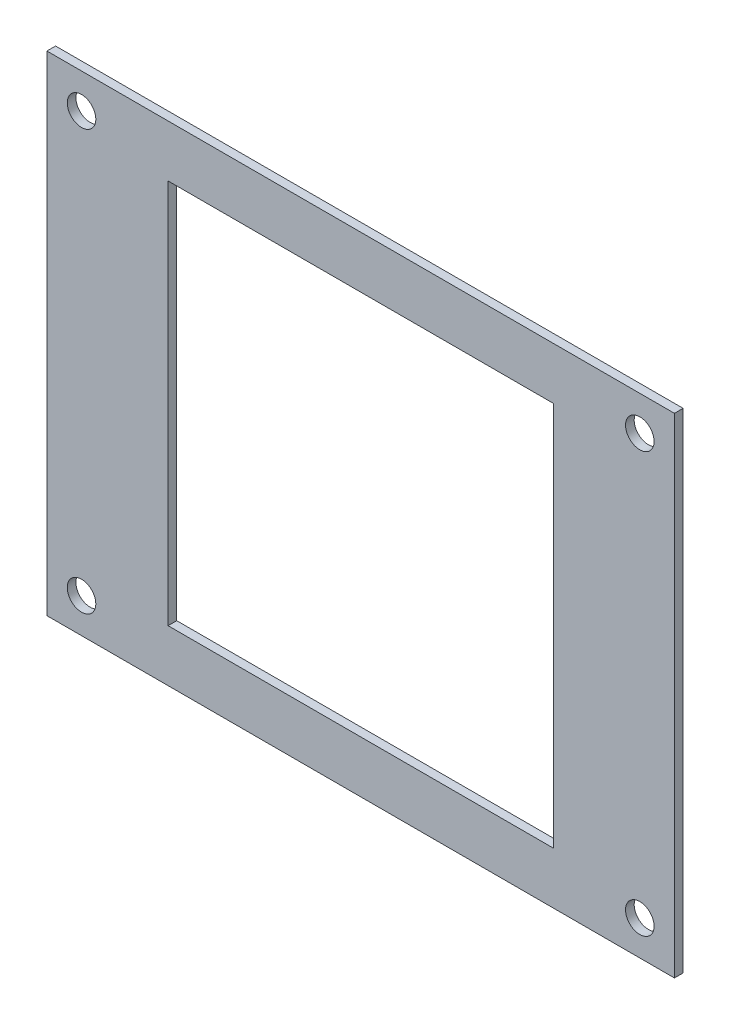
ISO-10303-21;
HEADER;
FILE_DESCRIPTION(('STEP AP214'),'2;1');
FILE_NAME('part.step','',(''),(''),'','','');
FILE_SCHEMA(('AUTOMOTIVE_DESIGN { 1 0 10303 214 1 1 1 1 }'));
ENDSEC;
DATA;
#1=APPLICATION_CONTEXT('core data for automotive mechanical design processes');
#2=APPLICATION_PROTOCOL_DEFINITION('international standard','automotive_design',2000,#1);
#3=PRODUCT_CONTEXT('',#1,'mechanical');
#4=PRODUCT('Part','Part','',(#3));
#5=PRODUCT_RELATED_PRODUCT_CATEGORY('part','',(#4));
#6=PRODUCT_DEFINITION_FORMATION('','',#4);
#7=PRODUCT_DEFINITION_CONTEXT('part definition',#1,'design');
#8=PRODUCT_DEFINITION('design','',#6,#7);
#9=PRODUCT_DEFINITION_SHAPE('','',#8);
#10=(LENGTH_UNIT() NAMED_UNIT(*) SI_UNIT(.MILLI.,.METRE.));
#11=(NAMED_UNIT(*) PLANE_ANGLE_UNIT() SI_UNIT($,.RADIAN.));
#12=(NAMED_UNIT(*) SI_UNIT($,.STERADIAN.) SOLID_ANGLE_UNIT());
#13=UNCERTAINTY_MEASURE_WITH_UNIT(LENGTH_MEASURE(1.E-05),#10,'distance_accuracy_value','');
#14=(GEOMETRIC_REPRESENTATION_CONTEXT(3) GLOBAL_UNCERTAINTY_ASSIGNED_CONTEXT((#13)) GLOBAL_UNIT_ASSIGNED_CONTEXT((#10,
#11,#12)) REPRESENTATION_CONTEXT('',''));
#15=CARTESIAN_POINT('',(0.,0.,0.));
#16=DIRECTION('',(0.,0.,1.));
#17=DIRECTION('',(1.,0.,0.));
#18=AXIS2_PLACEMENT_3D('',#15,#16,#17);
#19=CARTESIAN_POINT('',(0.,0.,1.));
#20=DIRECTION('',(0.,0.,-1.));
#21=DIRECTION('',(-1.,0.,0.));
#22=AXIS2_PLACEMENT_3D('',#19,#20,#21);
#23=PLANE('',#22);
#24=CARTESIAN_POINT('',(-4.,4.,1.));
#25=DIRECTION('',(0.,0.,1.));
#26=DIRECTION('',(1.,0.,0.));
#27=AXIS2_PLACEMENT_3D('',#24,#25,#26);
#28=CIRCLE('',#27,1.65);
#29=CARTESIAN_POINT('',(-2.35,4.,1.));
#30=VERTEX_POINT('',#29);
#31=EDGE_CURVE('E159',#30,#30,#28,.T.);
#32=ORIENTED_EDGE('',*,*,#31,.F.);
#33=EDGE_LOOP('',(#32));
#34=FACE_BOUND('',#33,.T.);
#35=CARTESIAN_POINT('',(-4.,52.5,1.));
#36=DIRECTION('',(0.,0.,1.));
#37=DIRECTION('',(1.,0.,0.));
#38=AXIS2_PLACEMENT_3D('',#35,#36,#37);
#39=CIRCLE('',#38,1.65);
#40=CARTESIAN_POINT('',(-2.35,52.5,1.));
#41=VERTEX_POINT('',#40);
#42=EDGE_CURVE('E167',#41,#41,#39,.T.);
#43=ORIENTED_EDGE('',*,*,#42,.F.);
#44=EDGE_LOOP('',(#43));
#45=FACE_BOUND('',#44,.T.);
#46=CARTESIAN_POINT('',(-68.5,52.5,1.));
#47=DIRECTION('',(0.,0.,1.));
#48=DIRECTION('',(1.,0.,0.));
#49=AXIS2_PLACEMENT_3D('',#46,#47,#48);
#50=CIRCLE('',#49,1.65);
#51=CARTESIAN_POINT('',(-66.85,52.5,1.));
#52=VERTEX_POINT('',#51);
#53=EDGE_CURVE('E175',#52,#52,#50,.T.);
#54=ORIENTED_EDGE('',*,*,#53,.F.);
#55=EDGE_LOOP('',(#54));
#56=FACE_BOUND('',#55,.T.);
#57=CARTESIAN_POINT('',(-68.5,4.,1.));
#58=DIRECTION('',(0.,0.,1.));
#59=DIRECTION('',(1.,0.,0.));
#60=AXIS2_PLACEMENT_3D('',#57,#58,#59);
#61=CIRCLE('',#60,1.65);
#62=CARTESIAN_POINT('',(-66.85,4.,1.));
#63=VERTEX_POINT('',#62);
#64=EDGE_CURVE('E183',#63,#63,#61,.T.);
#65=ORIENTED_EDGE('',*,*,#64,.F.);
#66=EDGE_LOOP('',(#65));
#67=FACE_BOUND('',#66,.T.);
#68=DIRECTION('',(1.,0.,0.));
#69=VECTOR('',#68,1.);
#70=CARTESIAN_POINT('',(0.,0.,1.));
#71=LINE('',#70,#69);
#72=CARTESIAN_POINT('',(-72.5,0.,1.));
#73=VERTEX_POINT('',#72);
#74=CARTESIAN_POINT('',(0.,0.,1.));
#75=VERTEX_POINT('',#74);
#76=EDGE_CURVE('E191',#73,#75,#71,.T.);
#77=ORIENTED_EDGE('',*,*,#76,.T.);
#78=DIRECTION('',(0.,1.,0.));
#79=VECTOR('',#78,1.);
#80=CARTESIAN_POINT('',(0.,0.,1.));
#81=LINE('',#80,#79);
#82=CARTESIAN_POINT('',(0.,56.5,1.));
#83=VERTEX_POINT('',#82);
#84=EDGE_CURVE('E195',#75,#83,#81,.T.);
#85=ORIENTED_EDGE('',*,*,#84,.T.);
#86=DIRECTION('',(-1.,0.,0.));
#87=VECTOR('',#86,1.);
#88=CARTESIAN_POINT('',(0.,56.5,1.));
#89=LINE('',#88,#87);
#90=CARTESIAN_POINT('',(-72.5,56.5,1.));
#91=VERTEX_POINT('',#90);
#92=EDGE_CURVE('E199',#83,#91,#89,.T.);
#93=ORIENTED_EDGE('',*,*,#92,.T.);
#94=DIRECTION('',(0.,-1.,0.));
#95=VECTOR('',#94,1.);
#96=CARTESIAN_POINT('',(-72.5,0.,1.));
#97=LINE('',#96,#95);
#98=EDGE_CURVE('E202',#91,#73,#97,.T.);
#99=ORIENTED_EDGE('',*,*,#98,.T.);
#100=EDGE_LOOP('',(#77,#85,#93,#99));
#101=FACE_BOUND('',#100,.T.);
#102=DIRECTION('',(1.,0.,0.));
#103=VECTOR('',#102,1.);
#104=CARTESIAN_POINT('',(-14.,6.,1.));
#105=LINE('',#104,#103);
#106=CARTESIAN_POINT('',(-58.5,6.,1.));
#107=VERTEX_POINT('',#106);
#108=CARTESIAN_POINT('',(-14.,6.,1.));
#109=VERTEX_POINT('',#108);
#110=EDGE_CURVE('E111',#107,#109,#105,.T.);
#111=ORIENTED_EDGE('',*,*,#110,.F.);
#112=DIRECTION('',(0.,-1.,0.));
#113=VECTOR('',#112,1.);
#114=CARTESIAN_POINT('',(-58.5,6.,1.));
#115=LINE('',#114,#113);
#116=CARTESIAN_POINT('',(-58.5,50.5,1.));
#117=VERTEX_POINT('',#116);
#118=EDGE_CURVE('E137',#117,#107,#115,.T.);
#119=ORIENTED_EDGE('',*,*,#118,.F.);
#120=DIRECTION('',(-1.,0.,0.));
#121=VECTOR('',#120,1.);
#122=CARTESIAN_POINT('',(-14.,50.5,1.));
#123=LINE('',#122,#121);
#124=CARTESIAN_POINT('',(-14.,50.5,1.));
#125=VERTEX_POINT('',#124);
#126=EDGE_CURVE('E133',#125,#117,#123,.T.);
#127=ORIENTED_EDGE('',*,*,#126,.F.);
#128=DIRECTION('',(0.,1.,0.));
#129=VECTOR('',#128,1.);
#130=CARTESIAN_POINT('',(-14.,6.,1.));
#131=LINE('',#130,#129);
#132=EDGE_CURVE('E120',#109,#125,#131,.T.);
#133=ORIENTED_EDGE('',*,*,#132,.F.);
#134=EDGE_LOOP('',(#111,#119,#127,#133));
#135=FACE_BOUND('',#134,.T.);
#136=ADVANCED_FACE('F45',(#34,#45,#56,#67,#101,#135),#23,.F.);
#137=CARTESIAN_POINT('',(0.,0.,0.));
#138=DIRECTION('',(0.,0.,-1.));
#139=DIRECTION('',(-1.,0.,0.));
#140=AXIS2_PLACEMENT_3D('',#137,#138,#139);
#141=PLANE('',#140);
#142=CARTESIAN_POINT('',(-4.,52.5,0.));
#143=DIRECTION('',(0.,0.,1.));
#144=DIRECTION('',(1.,0.,0.));
#145=AXIS2_PLACEMENT_3D('',#142,#143,#144);
#146=CIRCLE('',#145,1.65);
#147=CARTESIAN_POINT('',(-2.35,52.5,0.));
#148=VERTEX_POINT('',#147);
#149=EDGE_CURVE('E163',#148,#148,#146,.T.);
#150=ORIENTED_EDGE('',*,*,#149,.T.);
#151=EDGE_LOOP('',(#150));
#152=FACE_BOUND('',#151,.T.);
#153=CARTESIAN_POINT('',(-68.5,4.,0.));
#154=DIRECTION('',(0.,0.,1.));
#155=DIRECTION('',(1.,0.,0.));
#156=AXIS2_PLACEMENT_3D('',#153,#154,#155);
#157=CIRCLE('',#156,1.65);
#158=CARTESIAN_POINT('',(-66.85,4.,0.));
#159=VERTEX_POINT('',#158);
#160=EDGE_CURVE('E179',#159,#159,#157,.T.);
#161=ORIENTED_EDGE('',*,*,#160,.T.);
#162=EDGE_LOOP('',(#161));
#163=FACE_BOUND('',#162,.T.);
#164=DIRECTION('',(1.,0.,0.));
#165=VECTOR('',#164,1.);
#166=CARTESIAN_POINT('',(0.,0.,0.));
#167=LINE('',#166,#165);
#168=CARTESIAN_POINT('',(-72.5,0.,0.));
#169=VERTEX_POINT('',#168);
#170=CARTESIAN_POINT('',(0.,0.,0.));
#171=VERTEX_POINT('',#170);
#172=EDGE_CURVE('E187',#169,#171,#167,.T.);
#173=ORIENTED_EDGE('',*,*,#172,.F.);
#174=DIRECTION('',(0.,-1.,0.));
#175=VECTOR('',#174,1.);
#176=CARTESIAN_POINT('',(-72.5,0.,0.));
#177=LINE('',#176,#175);
#178=CARTESIAN_POINT('',(-72.5,56.5,0.));
#179=VERTEX_POINT('',#178);
#180=EDGE_CURVE('E196',#179,#169,#177,.T.);
#181=ORIENTED_EDGE('',*,*,#180,.F.);
#182=DIRECTION('',(-1.,0.,0.));
#183=VECTOR('',#182,1.);
#184=CARTESIAN_POINT('',(0.,56.5,0.));
#185=LINE('',#184,#183);
#186=CARTESIAN_POINT('',(0.,56.5,0.));
#187=VERTEX_POINT('',#186);
#188=EDGE_CURVE('E212',#187,#179,#185,.T.);
#189=ORIENTED_EDGE('',*,*,#188,.F.);
#190=DIRECTION('',(0.,1.,0.));
#191=VECTOR('',#190,1.);
#192=CARTESIAN_POINT('',(0.,0.,0.));
#193=LINE('',#192,#191);
#194=EDGE_CURVE('E209',#171,#187,#193,.T.);
#195=ORIENTED_EDGE('',*,*,#194,.F.);
#196=EDGE_LOOP('',(#173,#181,#189,#195));
#197=FACE_BOUND('',#196,.T.);
#198=CARTESIAN_POINT('',(-68.5,52.5,0.));
#199=DIRECTION('',(0.,0.,1.));
#200=DIRECTION('',(1.,0.,0.));
#201=AXIS2_PLACEMENT_3D('',#198,#199,#200);
#202=CIRCLE('',#201,1.65);
#203=CARTESIAN_POINT('',(-66.85,52.5,0.));
#204=VERTEX_POINT('',#203);
#205=EDGE_CURVE('E171',#204,#204,#202,.T.);
#206=ORIENTED_EDGE('',*,*,#205,.T.);
#207=EDGE_LOOP('',(#206));
#208=FACE_BOUND('',#207,.T.);
#209=CARTESIAN_POINT('',(-4.,4.,0.));
#210=DIRECTION('',(0.,0.,1.));
#211=DIRECTION('',(1.,0.,0.));
#212=AXIS2_PLACEMENT_3D('',#209,#210,#211);
#213=CIRCLE('',#212,1.65);
#214=CARTESIAN_POINT('',(-2.35,4.,0.));
#215=VERTEX_POINT('',#214);
#216=EDGE_CURVE('E129',#215,#215,#213,.T.);
#217=ORIENTED_EDGE('',*,*,#216,.T.);
#218=EDGE_LOOP('',(#217));
#219=FACE_BOUND('',#218,.T.);
#220=DIRECTION('',(0.,-1.,0.));
#221=VECTOR('',#220,1.);
#222=CARTESIAN_POINT('',(-58.5,6.,0.));
#223=LINE('',#222,#221);
#224=CARTESIAN_POINT('',(-58.5,50.5,0.));
#225=VERTEX_POINT('',#224);
#226=CARTESIAN_POINT('',(-58.5,6.,0.));
#227=VERTEX_POINT('',#226);
#228=EDGE_CURVE('E121',#225,#227,#223,.T.);
#229=ORIENTED_EDGE('',*,*,#228,.T.);
#230=DIRECTION('',(1.,0.,0.));
#231=VECTOR('',#230,1.);
#232=CARTESIAN_POINT('',(-14.,6.,0.));
#233=LINE('',#232,#231);
#234=CARTESIAN_POINT('',(-14.,6.,0.));
#235=VERTEX_POINT('',#234);
#236=EDGE_CURVE('E69',#227,#235,#233,.T.);
#237=ORIENTED_EDGE('',*,*,#236,.T.);
#238=DIRECTION('',(0.,1.,0.));
#239=VECTOR('',#238,1.);
#240=CARTESIAN_POINT('',(-14.,6.,0.));
#241=LINE('',#240,#239);
#242=CARTESIAN_POINT('',(-14.,50.5,0.));
#243=VERTEX_POINT('',#242);
#244=EDGE_CURVE('E127',#235,#243,#241,.T.);
#245=ORIENTED_EDGE('',*,*,#244,.T.);
#246=DIRECTION('',(-1.,0.,0.));
#247=VECTOR('',#246,1.);
#248=CARTESIAN_POINT('',(-14.,50.5,0.));
#249=LINE('',#248,#247);
#250=EDGE_CURVE('E146',#243,#225,#249,.T.);
#251=ORIENTED_EDGE('',*,*,#250,.T.);
#252=EDGE_LOOP('',(#229,#237,#245,#251));
#253=FACE_BOUND('',#252,.T.);
#254=ADVANCED_FACE('F235',(#152,#163,#197,#208,#219,#253),#141,.T.);
#255=CARTESIAN_POINT('',(0.,0.,1.));
#256=DIRECTION('',(0.,1.,0.));
#257=DIRECTION('',(0.,0.,1.));
#258=AXIS2_PLACEMENT_3D('',#255,#256,#257);
#259=PLANE('',#258);
#260=ORIENTED_EDGE('',*,*,#172,.T.);
#261=DIRECTION('',(0.,0.,-1.));
#262=VECTOR('',#261,1.);
#263=CARTESIAN_POINT('',(0.,0.,1.));
#264=LINE('',#263,#262);
#265=EDGE_CURVE('E11',#75,#171,#264,.T.);
#266=ORIENTED_EDGE('',*,*,#265,.F.);
#267=ORIENTED_EDGE('',*,*,#76,.F.);
#268=DIRECTION('',(0.,0.,-1.));
#269=VECTOR('',#268,1.);
#270=CARTESIAN_POINT('',(-72.5,0.,1.));
#271=LINE('',#270,#269);
#272=EDGE_CURVE('E205',#73,#169,#271,.T.);
#273=ORIENTED_EDGE('',*,*,#272,.T.);
#274=EDGE_LOOP('',(#260,#266,#267,#273));
#275=FACE_BOUND('',#274,.T.);
#276=ADVANCED_FACE('F47',(#275),#259,.F.);
#277=CARTESIAN_POINT('',(0.,0.,1.));
#278=DIRECTION('',(-1.,0.,0.));
#279=DIRECTION('',(0.,0.,1.));
#280=AXIS2_PLACEMENT_3D('',#277,#278,#279);
#281=PLANE('',#280);
#282=ORIENTED_EDGE('',*,*,#194,.T.);
#283=DIRECTION('',(0.,0.,-1.));
#284=VECTOR('',#283,1.);
#285=CARTESIAN_POINT('',(0.,56.5,1.));
#286=LINE('',#285,#284);
#287=EDGE_CURVE('E54',#83,#187,#286,.T.);
#288=ORIENTED_EDGE('',*,*,#287,.F.);
#289=ORIENTED_EDGE('',*,*,#84,.F.);
#290=ORIENTED_EDGE('',*,*,#265,.T.);
#291=EDGE_LOOP('',(#282,#288,#289,#290));
#292=FACE_BOUND('',#291,.T.);
#293=ADVANCED_FACE('F245',(#292),#281,.F.);
#294=CARTESIAN_POINT('',(0.,56.5,1.));
#295=DIRECTION('',(0.,-1.,0.));
#296=DIRECTION('',(0.,0.,-1.));
#297=AXIS2_PLACEMENT_3D('',#294,#295,#296);
#298=PLANE('',#297);
#299=ORIENTED_EDGE('',*,*,#188,.T.);
#300=DIRECTION('',(0.,0.,-1.));
#301=VECTOR('',#300,1.);
#302=CARTESIAN_POINT('',(-72.5,56.5,1.));
#303=LINE('',#302,#301);
#304=EDGE_CURVE('E220',#91,#179,#303,.T.);
#305=ORIENTED_EDGE('',*,*,#304,.F.);
#306=ORIENTED_EDGE('',*,*,#92,.F.);
#307=ORIENTED_EDGE('',*,*,#287,.T.);
#308=EDGE_LOOP('',(#299,#305,#306,#307));
#309=FACE_BOUND('',#308,.T.);
#310=ADVANCED_FACE('F229',(#309),#298,.F.);
#311=CARTESIAN_POINT('',(-72.5,0.,1.));
#312=DIRECTION('',(1.,0.,0.));
#313=DIRECTION('',(0.,0.,-1.));
#314=AXIS2_PLACEMENT_3D('',#311,#312,#313);
#315=PLANE('',#314);
#316=ORIENTED_EDGE('',*,*,#180,.T.);
#317=ORIENTED_EDGE('',*,*,#272,.F.);
#318=ORIENTED_EDGE('',*,*,#98,.F.);
#319=ORIENTED_EDGE('',*,*,#304,.T.);
#320=EDGE_LOOP('',(#316,#317,#318,#319));
#321=FACE_BOUND('',#320,.T.);
#322=ADVANCED_FACE('F239',(#321),#315,.F.);
#323=CARTESIAN_POINT('',(-68.5,4.,1.));
#324=DIRECTION('',(0.,0.,-1.));
#325=DIRECTION('',(-1.,0.,0.));
#326=AXIS2_PLACEMENT_3D('',#323,#324,#325);
#327=CYLINDRICAL_SURFACE('',#326,1.65);
#328=ORIENTED_EDGE('',*,*,#64,.T.);
#329=EDGE_LOOP('',(#328));
#330=FACE_BOUND('',#329,.T.);
#331=ORIENTED_EDGE('',*,*,#160,.F.);
#332=EDGE_LOOP('',(#331));
#333=FACE_BOUND('',#332,.T.);
#334=ADVANCED_FACE('F263',(#330,#333),#327,.F.);
#335=CARTESIAN_POINT('',(-68.5,52.5,1.));
#336=DIRECTION('',(0.,0.,-1.));
#337=DIRECTION('',(-1.,0.,0.));
#338=AXIS2_PLACEMENT_3D('',#335,#336,#337);
#339=CYLINDRICAL_SURFACE('',#338,1.65);
#340=ORIENTED_EDGE('',*,*,#53,.T.);
#341=EDGE_LOOP('',(#340));
#342=FACE_BOUND('',#341,.T.);
#343=ORIENTED_EDGE('',*,*,#205,.F.);
#344=EDGE_LOOP('',(#343));
#345=FACE_BOUND('',#344,.T.);
#346=ADVANCED_FACE('F270',(#342,#345),#339,.F.);
#347=CARTESIAN_POINT('',(-4.,52.5,1.));
#348=DIRECTION('',(0.,0.,-1.));
#349=DIRECTION('',(-1.,0.,0.));
#350=AXIS2_PLACEMENT_3D('',#347,#348,#349);
#351=CYLINDRICAL_SURFACE('',#350,1.65);
#352=ORIENTED_EDGE('',*,*,#42,.T.);
#353=EDGE_LOOP('',(#352));
#354=FACE_BOUND('',#353,.T.);
#355=ORIENTED_EDGE('',*,*,#149,.F.);
#356=EDGE_LOOP('',(#355));
#357=FACE_BOUND('',#356,.T.);
#358=ADVANCED_FACE('F275',(#354,#357),#351,.F.);
#359=CARTESIAN_POINT('',(-4.,4.,1.));
#360=DIRECTION('',(0.,0.,-1.));
#361=DIRECTION('',(-1.,0.,0.));
#362=AXIS2_PLACEMENT_3D('',#359,#360,#361);
#363=CYLINDRICAL_SURFACE('',#362,1.65);
#364=ORIENTED_EDGE('',*,*,#31,.T.);
#365=EDGE_LOOP('',(#364));
#366=FACE_BOUND('',#365,.T.);
#367=ORIENTED_EDGE('',*,*,#216,.F.);
#368=EDGE_LOOP('',(#367));
#369=FACE_BOUND('',#368,.T.);
#370=ADVANCED_FACE('F285',(#366,#369),#363,.F.);
#371=CARTESIAN_POINT('',(-14.,6.,1.));
#372=DIRECTION('',(0.,1.,0.));
#373=DIRECTION('',(0.,0.,1.));
#374=AXIS2_PLACEMENT_3D('',#371,#372,#373);
#375=PLANE('',#374);
#376=ORIENTED_EDGE('',*,*,#236,.F.);
#377=DIRECTION('',(0.,0.,-1.));
#378=VECTOR('',#377,1.);
#379=CARTESIAN_POINT('',(-58.5,6.,1.));
#380=LINE('',#379,#378);
#381=EDGE_CURVE('E115',#107,#227,#380,.T.);
#382=ORIENTED_EDGE('',*,*,#381,.F.);
#383=ORIENTED_EDGE('',*,*,#110,.T.);
#384=DIRECTION('',(0.,0.,-1.));
#385=VECTOR('',#384,1.);
#386=CARTESIAN_POINT('',(-14.,6.,1.));
#387=LINE('',#386,#385);
#388=EDGE_CURVE('E114',#109,#235,#387,.T.);
#389=ORIENTED_EDGE('',*,*,#388,.T.);
#390=EDGE_LOOP('',(#376,#382,#383,#389));
#391=FACE_BOUND('',#390,.T.);
#392=ADVANCED_FACE('F113',(#391),#375,.T.);
#393=CARTESIAN_POINT('',(-14.,6.,1.));
#394=DIRECTION('',(-1.,0.,0.));
#395=DIRECTION('',(0.,0.,1.));
#396=AXIS2_PLACEMENT_3D('',#393,#394,#395);
#397=PLANE('',#396);
#398=ORIENTED_EDGE('',*,*,#244,.F.);
#399=ORIENTED_EDGE('',*,*,#388,.F.);
#400=ORIENTED_EDGE('',*,*,#132,.T.);
#401=DIRECTION('',(0.,0.,-1.));
#402=VECTOR('',#401,1.);
#403=CARTESIAN_POINT('',(-14.,50.5,1.));
#404=LINE('',#403,#402);
#405=EDGE_CURVE('E130',#125,#243,#404,.T.);
#406=ORIENTED_EDGE('',*,*,#405,.T.);
#407=EDGE_LOOP('',(#398,#399,#400,#406));
#408=FACE_BOUND('',#407,.T.);
#409=ADVANCED_FACE('F124',(#408),#397,.T.);
#410=CARTESIAN_POINT('',(-14.,50.5,1.));
#411=DIRECTION('',(0.,-1.,0.));
#412=DIRECTION('',(0.,0.,-1.));
#413=AXIS2_PLACEMENT_3D('',#410,#411,#412);
#414=PLANE('',#413);
#415=ORIENTED_EDGE('',*,*,#250,.F.);
#416=ORIENTED_EDGE('',*,*,#405,.F.);
#417=ORIENTED_EDGE('',*,*,#126,.T.);
#418=DIRECTION('',(0.,0.,-1.));
#419=VECTOR('',#418,1.);
#420=CARTESIAN_POINT('',(-58.5,50.5,1.));
#421=LINE('',#420,#419);
#422=EDGE_CURVE('E61',#117,#225,#421,.T.);
#423=ORIENTED_EDGE('',*,*,#422,.T.);
#424=EDGE_LOOP('',(#415,#416,#417,#423));
#425=FACE_BOUND('',#424,.T.);
#426=ADVANCED_FACE('F297',(#425),#414,.T.);
#427=CARTESIAN_POINT('',(-58.5,6.,1.));
#428=DIRECTION('',(1.,0.,0.));
#429=DIRECTION('',(0.,0.,-1.));
#430=AXIS2_PLACEMENT_3D('',#427,#428,#429);
#431=PLANE('',#430);
#432=ORIENTED_EDGE('',*,*,#228,.F.);
#433=ORIENTED_EDGE('',*,*,#422,.F.);
#434=ORIENTED_EDGE('',*,*,#118,.T.);
#435=ORIENTED_EDGE('',*,*,#381,.T.);
#436=EDGE_LOOP('',(#432,#433,#434,#435));
#437=FACE_BOUND('',#436,.T.);
#438=ADVANCED_FACE('F300',(#437),#431,.T.);
#439=CLOSED_SHELL('',(#136,#254,#276,#293,#310,#322,#334,#346,#358,#370,#392,#409,#426,#438));
#440=MANIFOLD_SOLID_BREP('B2',#439);
#441=ADVANCED_BREP_SHAPE_REPRESENTATION('',(#18,#440),#14);
#442=SHAPE_DEFINITION_REPRESENTATION(#9,#441);
ENDSEC;
END-ISO-10303-21;
